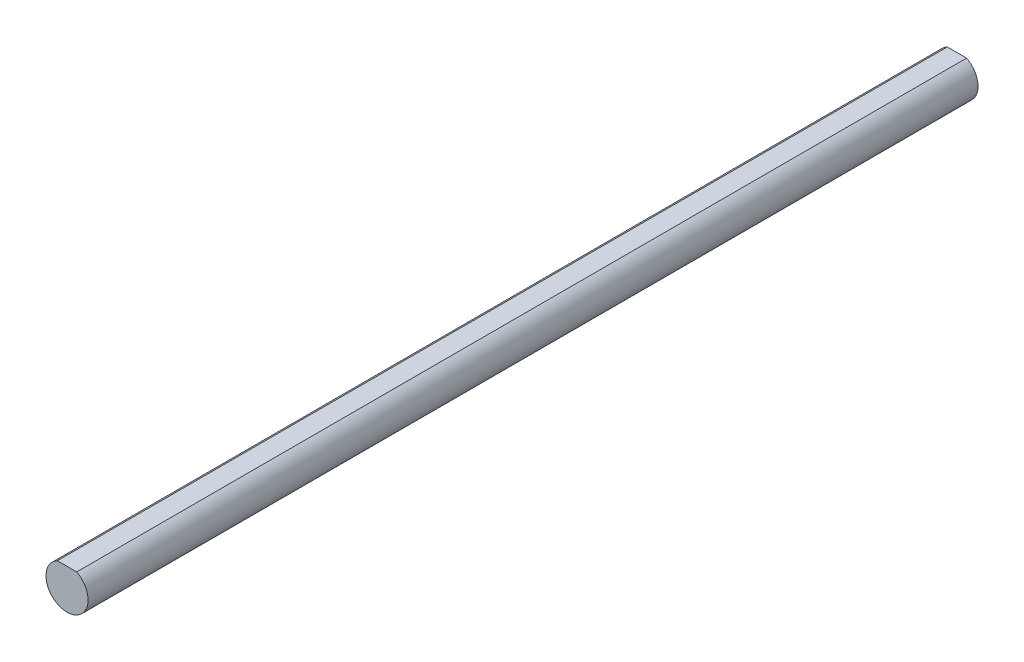
ISO-10303-21;
HEADER;
FILE_DESCRIPTION(('STEP AP214'),'2;1');
FILE_NAME('part.step','',(''),(''),'','','');
FILE_SCHEMA(('AUTOMOTIVE_DESIGN { 1 0 10303 214 1 1 1 1 }'));
ENDSEC;
DATA;
#1=APPLICATION_CONTEXT('core data for automotive mechanical design processes');
#2=APPLICATION_PROTOCOL_DEFINITION('international standard','automotive_design',2000,#1);
#3=PRODUCT_CONTEXT('',#1,'mechanical');
#4=PRODUCT('Part','Part','',(#3));
#5=PRODUCT_RELATED_PRODUCT_CATEGORY('part','',(#4));
#6=PRODUCT_DEFINITION_FORMATION('','',#4);
#7=PRODUCT_DEFINITION_CONTEXT('part definition',#1,'design');
#8=PRODUCT_DEFINITION('design','',#6,#7);
#9=PRODUCT_DEFINITION_SHAPE('','',#8);
#10=(LENGTH_UNIT() NAMED_UNIT(*) SI_UNIT(.MILLI.,.METRE.));
#11=(NAMED_UNIT(*) PLANE_ANGLE_UNIT() SI_UNIT($,.RADIAN.));
#12=(NAMED_UNIT(*) SI_UNIT($,.STERADIAN.) SOLID_ANGLE_UNIT());
#13=UNCERTAINTY_MEASURE_WITH_UNIT(LENGTH_MEASURE(1.E-05),#10,'distance_accuracy_value','');
#14=(GEOMETRIC_REPRESENTATION_CONTEXT(3) GLOBAL_UNCERTAINTY_ASSIGNED_CONTEXT((#13)) GLOBAL_UNIT_ASSIGNED_CONTEXT((#10,
#11,#12)) REPRESENTATION_CONTEXT('',''));
#15=CARTESIAN_POINT('',(0.,0.,0.));
#16=DIRECTION('',(0.,0.,1.));
#17=DIRECTION('',(1.,0.,0.));
#18=AXIS2_PLACEMENT_3D('',#15,#16,#17);
#19=CARTESIAN_POINT('',(0.,0.,50.));
#20=DIRECTION('',(0.,0.,-1.));
#21=DIRECTION('',(-1.,0.,0.));
#22=AXIS2_PLACEMENT_3D('',#19,#20,#21);
#23=CYLINDRICAL_SURFACE('',#22,2.365);
#24=DIRECTION('',(0.,0.,-1.));
#25=VECTOR('',#24,1.);
#26=CARTESIAN_POINT('',(-1.0877614628217,2.1,50.));
#27=LINE('',#26,#25);
#28=CARTESIAN_POINT('',(-1.0877614628217,2.1,50.));
#29=VERTEX_POINT('',#28);
#30=CARTESIAN_POINT('',(-1.0877614628217,2.1,-50.));
#31=VERTEX_POINT('',#30);
#32=EDGE_CURVE('E49',#29,#31,#27,.T.);
#33=ORIENTED_EDGE('',*,*,#32,.T.);
#34=CARTESIAN_POINT('',(0.,0.,-50.));
#35=DIRECTION('',(0.,0.,1.));
#36=DIRECTION('',(1.,0.,0.));
#37=AXIS2_PLACEMENT_3D('',#34,#35,#36);
#38=CIRCLE('',#37,2.365);
#39=CARTESIAN_POINT('',(1.0877614628217,2.1,-50.));
#40=VERTEX_POINT('',#39);
#41=EDGE_CURVE('E72',#31,#40,#38,.T.);
#42=ORIENTED_EDGE('',*,*,#41,.T.);
#43=DIRECTION('',(0.,0.,-1.));
#44=VECTOR('',#43,1.);
#45=CARTESIAN_POINT('',(1.0877614628217,2.1,50.));
#46=LINE('',#45,#44);
#47=CARTESIAN_POINT('',(1.0877614628217,2.1,50.));
#48=VERTEX_POINT('',#47);
#49=EDGE_CURVE('E13',#48,#40,#46,.T.);
#50=ORIENTED_EDGE('',*,*,#49,.F.);
#51=CARTESIAN_POINT('',(0.,0.,50.));
#52=DIRECTION('',(0.,0.,1.));
#53=DIRECTION('',(1.,0.,0.));
#54=AXIS2_PLACEMENT_3D('',#51,#52,#53);
#55=CIRCLE('',#54,2.365);
#56=EDGE_CURVE('E76',#29,#48,#55,.T.);
#57=ORIENTED_EDGE('',*,*,#56,.F.);
#58=EDGE_LOOP('',(#33,#42,#50,#57));
#59=FACE_BOUND('',#58,.T.);
#60=ADVANCED_FACE('F42',(#59),#23,.T.);
#61=CARTESIAN_POINT('',(1.0877614628217,2.1,50.));
#62=DIRECTION('',(0.,-1.,0.));
#63=DIRECTION('',(0.,0.,-1.));
#64=AXIS2_PLACEMENT_3D('',#61,#62,#63);
#65=PLANE('',#64);
#66=ORIENTED_EDGE('',*,*,#49,.T.);
#67=DIRECTION('',(-1.,0.,0.));
#68=VECTOR('',#67,1.);
#69=CARTESIAN_POINT('',(1.0877614628217,2.1,-50.));
#70=LINE('',#69,#68);
#71=EDGE_CURVE('E68',#40,#31,#70,.T.);
#72=ORIENTED_EDGE('',*,*,#71,.T.);
#73=ORIENTED_EDGE('',*,*,#32,.F.);
#74=DIRECTION('',(-1.,0.,0.));
#75=VECTOR('',#74,1.);
#76=CARTESIAN_POINT('',(1.0877614628217,2.1,50.));
#77=LINE('',#76,#75);
#78=EDGE_CURVE('E55',#48,#29,#77,.T.);
#79=ORIENTED_EDGE('',*,*,#78,.F.);
#80=EDGE_LOOP('',(#66,#72,#73,#79));
#81=FACE_BOUND('',#80,.T.);
#82=ADVANCED_FACE('F66',(#81),#65,.F.);
#83=CARTESIAN_POINT('',(0.,0.,50.));
#84=DIRECTION('',(0.,0.,1.));
#85=DIRECTION('',(1.,0.,0.));
#86=AXIS2_PLACEMENT_3D('',#83,#84,#85);
#87=PLANE('',#86);
#88=ORIENTED_EDGE('',*,*,#56,.T.);
#89=ORIENTED_EDGE('',*,*,#78,.T.);
#90=EDGE_LOOP('',(#88,#89));
#91=FACE_BOUND('',#90,.T.);
#92=ADVANCED_FACE('F80',(#91),#87,.T.);
#93=CARTESIAN_POINT('',(0.,0.,-50.));
#94=DIRECTION('',(0.,0.,1.));
#95=DIRECTION('',(1.,0.,0.));
#96=AXIS2_PLACEMENT_3D('',#93,#94,#95);
#97=PLANE('',#96);
#98=ORIENTED_EDGE('',*,*,#41,.F.);
#99=ORIENTED_EDGE('',*,*,#71,.F.);
#100=EDGE_LOOP('',(#98,#99));
#101=FACE_BOUND('',#100,.T.);
#102=ADVANCED_FACE('F75',(#101),#97,.F.);
#103=CLOSED_SHELL('',(#60,#82,#92,#102));
#104=MANIFOLD_SOLID_BREP('B2',#103);
#105=ADVANCED_BREP_SHAPE_REPRESENTATION('',(#18,#104),#14);
#106=SHAPE_DEFINITION_REPRESENTATION(#9,#105);
ENDSEC;
END-ISO-10303-21;
